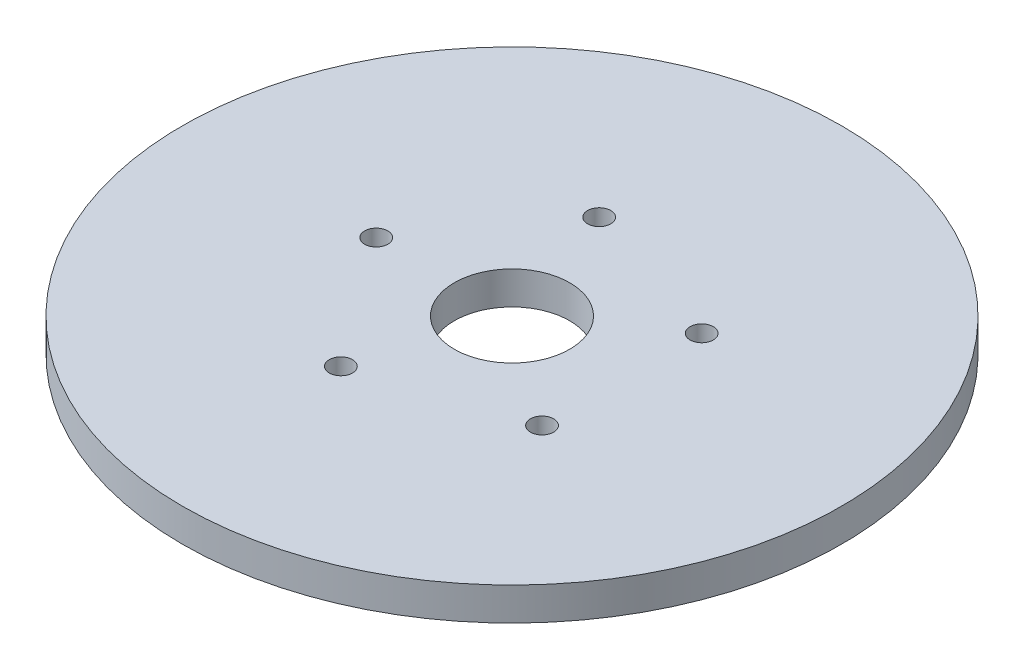
ISO-10303-21;
HEADER;
FILE_DESCRIPTION(('STEP AP214'),'2;1');
FILE_NAME('part.step','',(''),(''),'','','');
FILE_SCHEMA(('AUTOMOTIVE_DESIGN { 1 0 10303 214 1 1 1 1 }'));
ENDSEC;
DATA;
#1=APPLICATION_CONTEXT('core data for automotive mechanical design processes');
#2=APPLICATION_PROTOCOL_DEFINITION('international standard','automotive_design',2000,#1);
#3=PRODUCT_CONTEXT('',#1,'mechanical');
#4=PRODUCT('Part','Part','',(#3));
#5=PRODUCT_RELATED_PRODUCT_CATEGORY('part','',(#4));
#6=PRODUCT_DEFINITION_FORMATION('','',#4);
#7=PRODUCT_DEFINITION_CONTEXT('part definition',#1,'design');
#8=PRODUCT_DEFINITION('design','',#6,#7);
#9=PRODUCT_DEFINITION_SHAPE('','',#8);
#10=(LENGTH_UNIT() NAMED_UNIT(*) SI_UNIT(.MILLI.,.METRE.));
#11=(NAMED_UNIT(*) PLANE_ANGLE_UNIT() SI_UNIT($,.RADIAN.));
#12=(NAMED_UNIT(*) SI_UNIT($,.STERADIAN.) SOLID_ANGLE_UNIT());
#13=UNCERTAINTY_MEASURE_WITH_UNIT(LENGTH_MEASURE(1.E-05),#10,'distance_accuracy_value','');
#14=(GEOMETRIC_REPRESENTATION_CONTEXT(3) GLOBAL_UNCERTAINTY_ASSIGNED_CONTEXT((#13)) GLOBAL_UNIT_ASSIGNED_CONTEXT((#10,
#11,#12)) REPRESENTATION_CONTEXT('',''));
#15=CARTESIAN_POINT('',(0.,0.,0.));
#16=DIRECTION('',(0.,0.,1.));
#17=DIRECTION('',(1.,0.,0.));
#18=AXIS2_PLACEMENT_3D('',#15,#16,#17);
#19=CARTESIAN_POINT('',(0.,10.,0.));
#20=DIRECTION('',(0.,-1.,0.));
#21=DIRECTION('',(0.,0.,-1.));
#22=AXIS2_PLACEMENT_3D('',#19,#20,#21);
#23=CYLINDRICAL_SURFACE('',#22,100.);
#24=CARTESIAN_POINT('',(0.,10.,0.));
#25=DIRECTION('',(0.,1.,0.));
#26=DIRECTION('',(0.,0.,1.));
#27=AXIS2_PLACEMENT_3D('',#24,#25,#26);
#28=CIRCLE('',#27,100.);
#29=CARTESIAN_POINT('',(0.,10.,100.));
#30=VERTEX_POINT('',#29);
#31=EDGE_CURVE('E10',#30,#30,#28,.T.);
#32=ORIENTED_EDGE('',*,*,#31,.F.);
#33=EDGE_LOOP('',(#32));
#34=FACE_BOUND('',#33,.T.);
#35=CARTESIAN_POINT('',(0.,0.,0.));
#36=DIRECTION('',(0.,1.,0.));
#37=DIRECTION('',(0.,0.,1.));
#38=AXIS2_PLACEMENT_3D('',#35,#36,#37);
#39=CIRCLE('',#38,100.);
#40=CARTESIAN_POINT('',(0.,0.,100.));
#41=VERTEX_POINT('',#40);
#42=EDGE_CURVE('E37',#41,#41,#39,.T.);
#43=ORIENTED_EDGE('',*,*,#42,.T.);
#44=EDGE_LOOP('',(#43));
#45=FACE_BOUND('',#44,.T.);
#46=ADVANCED_FACE('F40',(#34,#45),#23,.T.);
#47=CARTESIAN_POINT('',(0.,10.,0.));
#48=DIRECTION('',(0.,1.,0.));
#49=DIRECTION('',(0.,0.,1.));
#50=AXIS2_PLACEMENT_3D('',#47,#48,#49);
#51=PLANE('',#50);
#52=CARTESIAN_POINT('',(-12.7339769297257,10.,39.1911511593866));
#53=DIRECTION('',(0.,1.,0.));
#54=DIRECTION('',(0.951056516295155,0.,0.309016994374945));
#55=AXIS2_PLACEMENT_3D('',#52,#53,#54);
#56=CIRCLE('',#55,3.52081027373652);
#57=CARTESIAN_POINT('',(-12.7339769297257,10.,42.7119614331232));
#58=VERTEX_POINT('',#57);
#59=EDGE_CURVE('E78',#58,#58,#56,.T.);
#60=ORIENTED_EDGE('',*,*,#59,.F.);
#61=EDGE_LOOP('',(#60));
#62=FACE_BOUND('',#61,.T.);
#63=CARTESIAN_POINT('',(33.3379844139793,10.,24.2214634747356));
#64=DIRECTION('',(0.,1.,0.));
#65=DIRECTION('',(0.587785252292469,0.,-0.809016994374951));
#66=AXIS2_PLACEMENT_3D('',#63,#64,#65);
#67=CIRCLE('',#66,3.52081027373652);
#68=CARTESIAN_POINT('',(33.3379844139793,10.,27.7422737484721));
#69=VERTEX_POINT('',#68);
#70=EDGE_CURVE('E71',#69,#69,#67,.T.);
#71=ORIENTED_EDGE('',*,*,#70,.F.);
#72=EDGE_LOOP('',(#71));
#73=FACE_BOUND('',#72,.T.);
#74=CARTESIAN_POINT('',(33.337984413979,10.,-24.2214634747361));
#75=DIRECTION('',(0.,1.,0.));
#76=DIRECTION('',(-0.58778525229248,0.,-0.809016994374942));
#77=AXIS2_PLACEMENT_3D('',#74,#75,#76);
#78=CIRCLE('',#77,3.52081027373652);
#79=CARTESIAN_POINT('',(33.337984413979,10.,-20.7006532009995));
#80=VERTEX_POINT('',#79);
#81=EDGE_CURVE('E70',#80,#80,#78,.T.);
#82=ORIENTED_EDGE('',*,*,#81,.F.);
#83=EDGE_LOOP('',(#82));
#84=FACE_BOUND('',#83,.T.);
#85=CARTESIAN_POINT('',(-12.7339769297262,10.,-39.1911511593865));
#86=DIRECTION('',(0.,1.,0.));
#87=DIRECTION('',(-0.95105651629515,0.,0.309016994374958));
#88=AXIS2_PLACEMENT_3D('',#85,#86,#87);
#89=CIRCLE('',#88,3.52081027373652);
#90=CARTESIAN_POINT('',(-12.7339769297262,10.,-35.6703408856499));
#91=VERTEX_POINT('',#90);
#92=EDGE_CURVE('E61',#91,#91,#89,.T.);
#93=ORIENTED_EDGE('',*,*,#92,.F.);
#94=EDGE_LOOP('',(#93));
#95=FACE_BOUND('',#94,.T.);
#96=CARTESIAN_POINT('',(-41.2080149685068,10.,0.));
#97=DIRECTION('',(0.,1.,0.));
#98=DIRECTION('',(0.,0.,1.));
#99=AXIS2_PLACEMENT_3D('',#96,#97,#98);
#100=CIRCLE('',#99,3.52081027373652);
#101=CARTESIAN_POINT('',(-41.2080149685068,10.,3.52081027373652));
#102=VERTEX_POINT('',#101);
#103=EDGE_CURVE('E54',#102,#102,#100,.T.);
#104=ORIENTED_EDGE('',*,*,#103,.F.);
#105=EDGE_LOOP('',(#104));
#106=FACE_BOUND('',#105,.T.);
#107=CARTESIAN_POINT('',(0.,10.,0.));
#108=DIRECTION('',(0.,1.,0.));
#109=DIRECTION('',(0.,0.,1.));
#110=AXIS2_PLACEMENT_3D('',#107,#108,#109);
#111=CIRCLE('',#110,17.5);
#112=CARTESIAN_POINT('',(0.,10.,17.5));
#113=VERTEX_POINT('',#112);
#114=EDGE_CURVE('E50',#113,#113,#111,.T.);
#115=ORIENTED_EDGE('',*,*,#114,.F.);
#116=EDGE_LOOP('',(#115));
#117=FACE_BOUND('',#116,.T.);
#118=ORIENTED_EDGE('',*,*,#31,.T.);
#119=EDGE_LOOP('',(#118));
#120=FACE_BOUND('',#119,.T.);
#121=ADVANCED_FACE('F94',(#62,#73,#84,#95,#106,#117,#120),#51,.T.);
#122=CARTESIAN_POINT('',(0.,0.,0.));
#123=DIRECTION('',(0.,1.,0.));
#124=DIRECTION('',(0.,0.,1.));
#125=AXIS2_PLACEMENT_3D('',#122,#123,#124);
#126=PLANE('',#125);
#127=CARTESIAN_POINT('',(0.,0.,0.));
#128=DIRECTION('',(0.,1.,0.));
#129=DIRECTION('',(0.,0.,1.));
#130=AXIS2_PLACEMENT_3D('',#127,#128,#129);
#131=CIRCLE('',#130,17.5);
#132=CARTESIAN_POINT('',(0.,0.,17.5));
#133=VERTEX_POINT('',#132);
#134=EDGE_CURVE('E47',#133,#133,#131,.T.);
#135=ORIENTED_EDGE('',*,*,#134,.T.);
#136=EDGE_LOOP('',(#135));
#137=FACE_BOUND('',#136,.T.);
#138=ORIENTED_EDGE('',*,*,#42,.F.);
#139=EDGE_LOOP('',(#138));
#140=FACE_BOUND('',#139,.T.);
#141=ADVANCED_FACE('F100',(#137,#140),#126,.F.);
#142=CARTESIAN_POINT('',(0.,10.,0.));
#143=DIRECTION('',(0.,-1.,0.));
#144=DIRECTION('',(0.,0.,-1.));
#145=AXIS2_PLACEMENT_3D('',#142,#143,#144);
#146=CYLINDRICAL_SURFACE('',#145,17.5);
#147=ORIENTED_EDGE('',*,*,#114,.T.);
#148=EDGE_LOOP('',(#147));
#149=FACE_BOUND('',#148,.T.);
#150=ORIENTED_EDGE('',*,*,#134,.F.);
#151=EDGE_LOOP('',(#150));
#152=FACE_BOUND('',#151,.T.);
#153=ADVANCED_FACE('F108',(#149,#152),#146,.F.);
#154=CARTESIAN_POINT('',(-41.2080149685068,2.43888670709305,0.));
#155=DIRECTION('',(0.,1.,0.));
#156=DIRECTION('',(0.,0.,1.));
#157=AXIS2_PLACEMENT_3D('',#154,#155,#156);
#158=CYLINDRICAL_SURFACE('',#157,3.52081027373652);
#159=CARTESIAN_POINT('',(-41.2080149685068,2.43888670709305,0.));
#160=DIRECTION('',(0.,1.,0.));
#161=DIRECTION('',(0.,0.,1.));
#162=AXIS2_PLACEMENT_3D('',#159,#160,#161);
#163=CIRCLE('',#162,3.52081027373652);
#164=CARTESIAN_POINT('',(-41.2080149685068,2.43888670709305,3.52081027373652));
#165=VERTEX_POINT('',#164);
#166=EDGE_CURVE('E55',#165,#165,#163,.T.);
#167=CARTESIAN_POINT('',(-41.2080149685068,2.43888670709305,3.52081027373652));
#168=CARTESIAN_POINT('',(-41.2080149685068,2.51764830389416,3.52081027373652));
#169=CARTESIAN_POINT('',(-41.2080149685068,2.59640990069528,3.52081027373652));
#170=CARTESIAN_POINT('',(-41.2080149685068,2.75393309429751,3.52081027373652));
#171=CARTESIAN_POINT('',(-41.2080149685068,2.83269469109862,3.52081027373652));
#172=CARTESIAN_POINT('',(-41.2080149685068,2.99021788470085,3.52081027373652));
#173=CARTESIAN_POINT('',(-41.2080149685068,3.06897948150196,3.52081027373652));
#174=CARTESIAN_POINT('',(-41.2080149685068,3.22650267510419,3.52081027373652));
#175=CARTESIAN_POINT('',(-41.2080149685068,3.30526427190531,3.52081027373652));
#176=CARTESIAN_POINT('',(-41.2080149685068,3.46278746550753,3.52081027373652));
#177=CARTESIAN_POINT('',(-41.2080149685068,3.54154906230865,3.52081027373652));
#178=CARTESIAN_POINT('',(-41.2080149685068,3.69907225591088,3.52081027373652));
#179=CARTESIAN_POINT('',(-41.2080149685068,3.77783385271199,3.52081027373652));
#180=CARTESIAN_POINT('',(-41.2080149685068,3.93535704631422,3.52081027373652));
#181=CARTESIAN_POINT('',(-41.2080149685068,4.01411864311533,3.52081027373652));
#182=CARTESIAN_POINT('',(-41.2080149685068,4.17164183671756,3.52081027373652));
#183=CARTESIAN_POINT('',(-41.2080149685068,4.25040343351867,3.52081027373652));
#184=CARTESIAN_POINT('',(-41.2080149685068,4.4079266271209,3.52081027373652));
#185=CARTESIAN_POINT('',(-41.2080149685068,4.48668822392202,3.52081027373652));
#186=CARTESIAN_POINT('',(-41.2080149685068,4.64421141752424,3.52081027373652));
#187=CARTESIAN_POINT('',(-41.2080149685068,4.72297301432536,3.52081027373652));
#188=CARTESIAN_POINT('',(-41.2080149685068,4.88049620792759,3.52081027373652));
#189=CARTESIAN_POINT('',(-41.2080149685068,4.9592578047287,3.52081027373652));
#190=CARTESIAN_POINT('',(-41.2080149685068,5.11678099833093,3.52081027373652));
#191=CARTESIAN_POINT('',(-41.2080149685068,5.19554259513204,3.52081027373652));
#192=CARTESIAN_POINT('',(-41.2080149685068,5.35306578873427,3.52081027373652));
#193=CARTESIAN_POINT('',(-41.2080149685068,5.43182738553539,3.52081027373652));
#194=CARTESIAN_POINT('',(-41.2080149685068,5.58935057913761,3.52081027373652));
#195=CARTESIAN_POINT('',(-41.2080149685068,5.66811217593873,3.52081027373652));
#196=CARTESIAN_POINT('',(-41.2080149685068,5.82563536954095,3.52081027373652));
#197=CARTESIAN_POINT('',(-41.2080149685068,5.90439696634207,3.52081027373652));
#198=CARTESIAN_POINT('',(-41.2080149685068,6.0619201599443,3.52081027373652));
#199=CARTESIAN_POINT('',(-41.2080149685068,6.14068175674541,3.52081027373652));
#200=CARTESIAN_POINT('',(-41.2080149685068,6.29820495034764,3.52081027373652));
#201=CARTESIAN_POINT('',(-41.2080149685068,6.37696654714875,3.52081027373652));
#202=CARTESIAN_POINT('',(-41.2080149685068,6.53448974075098,3.52081027373652));
#203=CARTESIAN_POINT('',(-41.2080149685068,6.6132513375521,3.52081027373652));
#204=CARTESIAN_POINT('',(-41.2080149685068,6.77077453115432,3.52081027373652));
#205=CARTESIAN_POINT('',(-41.2080149685068,6.84953612795544,3.52081027373652));
#206=CARTESIAN_POINT('',(-41.2080149685068,7.00705932155767,3.52081027373652));
#207=CARTESIAN_POINT('',(-41.2080149685068,7.08582091835878,3.52081027373652));
#208=CARTESIAN_POINT('',(-41.2080149685068,7.24334411196101,3.52081027373652));
#209=CARTESIAN_POINT('',(-41.2080149685068,7.32210570876212,3.52081027373652));
#210=CARTESIAN_POINT('',(-41.2080149685068,7.47962890236435,3.52081027373652));
#211=CARTESIAN_POINT('',(-41.2080149685068,7.55839049916546,3.52081027373652));
#212=CARTESIAN_POINT('',(-41.2080149685068,7.71591369276769,3.52081027373652));
#213=CARTESIAN_POINT('',(-41.2080149685068,7.79467528956881,3.52081027373652));
#214=CARTESIAN_POINT('',(-41.2080149685068,7.95219848317103,3.52081027373652));
#215=CARTESIAN_POINT('',(-41.2080149685068,8.03096007997215,3.52081027373652));
#216=CARTESIAN_POINT('',(-41.2080149685068,8.18848327357438,3.52081027373652));
#217=CARTESIAN_POINT('',(-41.2080149685068,8.26724487037549,3.52081027373652));
#218=CARTESIAN_POINT('',(-41.2080149685068,8.42476806397772,3.52081027373652));
#219=CARTESIAN_POINT('',(-41.2080149685068,8.50352966077883,3.52081027373652));
#220=CARTESIAN_POINT('',(-41.2080149685068,8.66105285438106,3.52081027373652));
#221=CARTESIAN_POINT('',(-41.2080149685068,8.73981445118218,3.52081027373652));
#222=CARTESIAN_POINT('',(-41.2080149685068,8.8973376447844,3.52081027373652));
#223=CARTESIAN_POINT('',(-41.2080149685068,8.97609924158552,3.52081027373652));
#224=CARTESIAN_POINT('',(-41.2080149685068,9.13362243518775,3.52081027373652));
#225=CARTESIAN_POINT('',(-41.2080149685068,9.21238403198886,3.52081027373652));
#226=CARTESIAN_POINT('',(-41.2080149685068,9.36990722559109,3.52081027373652));
#227=CARTESIAN_POINT('',(-41.2080149685068,9.4486688223922,3.52081027373652));
#228=CARTESIAN_POINT('',(-41.2080149685068,9.60619201599443,3.52081027373652));
#229=CARTESIAN_POINT('',(-41.2080149685068,9.68495361279554,3.52081027373652));
#230=CARTESIAN_POINT('',(-41.2080149685068,9.84247680639777,3.52081027373652));
#231=CARTESIAN_POINT('',(-41.2080149685068,9.92123840319889,3.52081027373652));
#232=CARTESIAN_POINT('',(-41.2080149685068,10.,3.52081027373652));
#233=B_SPLINE_CURVE_WITH_KNOTS('',3,(#167,#168,#169,#170,#171,#172,#173,#174,#175,#176,#177,
#178,#179,#180,#181,#182,#183,#184,#185,#186,#187,#188,#189,#190,#191,#192,#193,#194,#195,#196,
#197,#198,#199,#200,#201,#202,#203,#204,#205,#206,#207,#208,#209,#210,#211,#212,#213,#214,#215,
#216,#217,#218,#219,#220,#221,#222,#223,#224,#225,#226,#227,#228,#229,#230,#231,#232),
.UNSPECIFIED.,.F.,.F.,(4,2,2,2,2,2,2,2,2,2,2,2,2,2,2,2,2,2,2,2,2,2,2,2,2,2,2,2,2,2,2,2,4),(0.,
0.236284790403342,0.472569580806684,0.708854371210027,0.945139161613369,1.18142395201671,
1.41770874242005,1.6539935328234,1.89027832322674,2.12656311363008,2.36284790403342,
2.59913269443676,2.83541748484011,3.07170227524345,3.30798706564679,3.54427185605013,
3.78055664645347,4.01684143685682,4.25312622726016,4.4894110176635,4.72569580806684,
4.96198059847019,5.19826538887353,5.43455017927687,5.67083496968021,5.90711976008355,
6.1434045504869,6.37968934089024,6.61597413129358,6.85225892169692,7.08854371210026,
7.32482850250361,7.56111329290695),.UNSPECIFIED.);
#234=EDGE_CURVE('BSEAM115',#165,#102,#233,.T.);
#235=ORIENTED_EDGE('',*,*,#166,.F.);
#236=ORIENTED_EDGE('',*,*,#103,.T.);
#237=ORIENTED_EDGE('',*,*,#234,.T.);
#238=ORIENTED_EDGE('',*,*,#234,.F.);
#239=EDGE_LOOP('',(#235,#237,#236,#238));
#240=FACE_BOUND('',#239,.T.);
#241=ADVANCED_FACE('F115',(#240),#158,.F.);
#242=CARTESIAN_POINT('',(-41.2080149685068,2.43888670709305,0.));
#243=DIRECTION('',(0.,1.,0.));
#244=DIRECTION('',(0.,0.,1.));
#245=AXIS2_PLACEMENT_3D('',#242,#243,#244);
#246=PLANE('',#245);
#247=ORIENTED_EDGE('',*,*,#166,.T.);
#248=EDGE_LOOP('',(#247));
#249=FACE_BOUND('',#248,.T.);
#250=ADVANCED_FACE('F142',(#249),#246,.T.);
#251=CARTESIAN_POINT('',(-12.7339769297262,2.43888670709305,-39.1911511593865));
#252=DIRECTION('',(0.,1.,0.));
#253=DIRECTION('',(0.,0.,1.));
#254=AXIS2_PLACEMENT_3D('',#251,#252,#253);
#255=CYLINDRICAL_SURFACE('',#254,3.52081027373652);
#256=CARTESIAN_POINT('',(-12.7339769297262,2.43888670709305,-39.1911511593865));
#257=DIRECTION('',(0.,1.,0.));
#258=DIRECTION('',(-0.95105651629515,0.,0.309016994374958));
#259=AXIS2_PLACEMENT_3D('',#256,#257,#258);
#260=CIRCLE('',#259,3.52081027373652);
#261=CARTESIAN_POINT('',(-12.7339769297262,2.43888670709305,-35.6703408856499));
#262=VERTEX_POINT('',#261);
#263=EDGE_CURVE('E63',#262,#262,#260,.T.);
#264=CARTESIAN_POINT('',(-12.7339769297262,2.43888670709305,-35.6703408856499));
#265=CARTESIAN_POINT('',(-12.7339769297262,2.51764830389416,-35.6703408856499));
#266=CARTESIAN_POINT('',(-12.7339769297262,2.59640990069528,-35.6703408856499));
#267=CARTESIAN_POINT('',(-12.7339769297262,2.75393309429751,-35.6703408856499));
#268=CARTESIAN_POINT('',(-12.7339769297262,2.83269469109862,-35.6703408856499));
#269=CARTESIAN_POINT('',(-12.7339769297262,2.99021788470085,-35.6703408856499));
#270=CARTESIAN_POINT('',(-12.7339769297262,3.06897948150196,-35.6703408856499));
#271=CARTESIAN_POINT('',(-12.7339769297262,3.22650267510419,-35.6703408856499));
#272=CARTESIAN_POINT('',(-12.7339769297262,3.30526427190531,-35.6703408856499));
#273=CARTESIAN_POINT('',(-12.7339769297262,3.46278746550753,-35.6703408856499));
#274=CARTESIAN_POINT('',(-12.7339769297262,3.54154906230865,-35.6703408856499));
#275=CARTESIAN_POINT('',(-12.7339769297262,3.69907225591088,-35.6703408856499));
#276=CARTESIAN_POINT('',(-12.7339769297262,3.77783385271199,-35.6703408856499));
#277=CARTESIAN_POINT('',(-12.7339769297262,3.93535704631422,-35.6703408856499));
#278=CARTESIAN_POINT('',(-12.7339769297262,4.01411864311533,-35.6703408856499));
#279=CARTESIAN_POINT('',(-12.7339769297262,4.17164183671756,-35.6703408856499));
#280=CARTESIAN_POINT('',(-12.7339769297262,4.25040343351867,-35.6703408856499));
#281=CARTESIAN_POINT('',(-12.7339769297262,4.4079266271209,-35.6703408856499));
#282=CARTESIAN_POINT('',(-12.7339769297262,4.48668822392202,-35.6703408856499));
#283=CARTESIAN_POINT('',(-12.7339769297262,4.64421141752424,-35.6703408856499));
#284=CARTESIAN_POINT('',(-12.7339769297262,4.72297301432536,-35.6703408856499));
#285=CARTESIAN_POINT('',(-12.7339769297262,4.88049620792759,-35.6703408856499));
#286=CARTESIAN_POINT('',(-12.7339769297262,4.9592578047287,-35.6703408856499));
#287=CARTESIAN_POINT('',(-12.7339769297262,5.11678099833093,-35.6703408856499));
#288=CARTESIAN_POINT('',(-12.7339769297262,5.19554259513204,-35.6703408856499));
#289=CARTESIAN_POINT('',(-12.7339769297262,5.35306578873427,-35.6703408856499));
#290=CARTESIAN_POINT('',(-12.7339769297262,5.43182738553539,-35.6703408856499));
#291=CARTESIAN_POINT('',(-12.7339769297262,5.58935057913761,-35.6703408856499));
#292=CARTESIAN_POINT('',(-12.7339769297262,5.66811217593873,-35.6703408856499));
#293=CARTESIAN_POINT('',(-12.7339769297262,5.82563536954095,-35.6703408856499));
#294=CARTESIAN_POINT('',(-12.7339769297262,5.90439696634207,-35.6703408856499));
#295=CARTESIAN_POINT('',(-12.7339769297262,6.0619201599443,-35.6703408856499));
#296=CARTESIAN_POINT('',(-12.7339769297262,6.14068175674541,-35.6703408856499));
#297=CARTESIAN_POINT('',(-12.7339769297262,6.29820495034764,-35.6703408856499));
#298=CARTESIAN_POINT('',(-12.7339769297262,6.37696654714875,-35.6703408856499));
#299=CARTESIAN_POINT('',(-12.7339769297262,6.53448974075098,-35.6703408856499));
#300=CARTESIAN_POINT('',(-12.7339769297262,6.6132513375521,-35.6703408856499));
#301=CARTESIAN_POINT('',(-12.7339769297262,6.77077453115432,-35.6703408856499));
#302=CARTESIAN_POINT('',(-12.7339769297262,6.84953612795544,-35.6703408856499));
#303=CARTESIAN_POINT('',(-12.7339769297262,7.00705932155767,-35.6703408856499));
#304=CARTESIAN_POINT('',(-12.7339769297262,7.08582091835878,-35.6703408856499));
#305=CARTESIAN_POINT('',(-12.7339769297262,7.24334411196101,-35.6703408856499));
#306=CARTESIAN_POINT('',(-12.7339769297262,7.32210570876212,-35.6703408856499));
#307=CARTESIAN_POINT('',(-12.7339769297262,7.47962890236435,-35.6703408856499));
#308=CARTESIAN_POINT('',(-12.7339769297262,7.55839049916546,-35.6703408856499));
#309=CARTESIAN_POINT('',(-12.7339769297262,7.71591369276769,-35.6703408856499));
#310=CARTESIAN_POINT('',(-12.7339769297262,7.79467528956881,-35.6703408856499));
#311=CARTESIAN_POINT('',(-12.7339769297262,7.95219848317103,-35.6703408856499));
#312=CARTESIAN_POINT('',(-12.7339769297262,8.03096007997215,-35.6703408856499));
#313=CARTESIAN_POINT('',(-12.7339769297262,8.18848327357438,-35.6703408856499));
#314=CARTESIAN_POINT('',(-12.7339769297262,8.26724487037549,-35.6703408856499));
#315=CARTESIAN_POINT('',(-12.7339769297262,8.42476806397772,-35.6703408856499));
#316=CARTESIAN_POINT('',(-12.7339769297262,8.50352966077883,-35.6703408856499));
#317=CARTESIAN_POINT('',(-12.7339769297262,8.66105285438106,-35.6703408856499));
#318=CARTESIAN_POINT('',(-12.7339769297262,8.73981445118218,-35.6703408856499));
#319=CARTESIAN_POINT('',(-12.7339769297262,8.8973376447844,-35.6703408856499));
#320=CARTESIAN_POINT('',(-12.7339769297262,8.97609924158552,-35.6703408856499));
#321=CARTESIAN_POINT('',(-12.7339769297262,9.13362243518775,-35.6703408856499));
#322=CARTESIAN_POINT('',(-12.7339769297262,9.21238403198886,-35.6703408856499));
#323=CARTESIAN_POINT('',(-12.7339769297262,9.36990722559109,-35.6703408856499));
#324=CARTESIAN_POINT('',(-12.7339769297262,9.4486688223922,-35.6703408856499));
#325=CARTESIAN_POINT('',(-12.7339769297262,9.60619201599443,-35.6703408856499));
#326=CARTESIAN_POINT('',(-12.7339769297262,9.68495361279554,-35.6703408856499));
#327=CARTESIAN_POINT('',(-12.7339769297262,9.84247680639777,-35.6703408856499));
#328=CARTESIAN_POINT('',(-12.7339769297262,9.92123840319889,-35.6703408856499));
#329=CARTESIAN_POINT('',(-12.7339769297262,10.,-35.6703408856499));
#330=B_SPLINE_CURVE_WITH_KNOTS('',3,(#264,#265,#266,#267,#268,#269,#270,#271,#272,#273,#274,
#275,#276,#277,#278,#279,#280,#281,#282,#283,#284,#285,#286,#287,#288,#289,#290,#291,#292,#293,
#294,#295,#296,#297,#298,#299,#300,#301,#302,#303,#304,#305,#306,#307,#308,#309,#310,#311,#312,
#313,#314,#315,#316,#317,#318,#319,#320,#321,#322,#323,#324,#325,#326,#327,#328,#329),
.UNSPECIFIED.,.F.,.F.,(4,2,2,2,2,2,2,2,2,2,2,2,2,2,2,2,2,2,2,2,2,2,2,2,2,2,2,2,2,2,2,2,4),(0.,
0.236284790403342,0.472569580806684,0.708854371210027,0.945139161613369,1.18142395201671,
1.41770874242005,1.6539935328234,1.89027832322674,2.12656311363008,2.36284790403342,
2.59913269443676,2.83541748484011,3.07170227524345,3.30798706564679,3.54427185605013,
3.78055664645347,4.01684143685682,4.25312622726016,4.4894110176635,4.72569580806684,
4.96198059847019,5.19826538887353,5.43455017927687,5.67083496968021,5.90711976008355,
6.1434045504869,6.37968934089024,6.61597413129358,6.85225892169692,7.08854371210026,
7.32482850250361,7.56111329290695),.UNSPECIFIED.);
#331=EDGE_CURVE('BSEAM147',#262,#91,#330,.T.);
#332=ORIENTED_EDGE('',*,*,#263,.F.);
#333=ORIENTED_EDGE('',*,*,#92,.T.);
#334=ORIENTED_EDGE('',*,*,#331,.T.);
#335=ORIENTED_EDGE('',*,*,#331,.F.);
#336=EDGE_LOOP('',(#332,#334,#333,#335));
#337=FACE_BOUND('',#336,.T.);
#338=ADVANCED_FACE('F147',(#337),#255,.F.);
#339=CARTESIAN_POINT('',(-12.7339769297262,2.43888670709305,-39.1911511593865));
#340=DIRECTION('',(0.,1.,0.));
#341=DIRECTION('',(-0.95105651629515,0.,0.309016994374958));
#342=AXIS2_PLACEMENT_3D('',#339,#340,#341);
#343=PLANE('',#342);
#344=ORIENTED_EDGE('',*,*,#263,.T.);
#345=EDGE_LOOP('',(#344));
#346=FACE_BOUND('',#345,.T.);
#347=ADVANCED_FACE('F163',(#346),#343,.T.);
#348=CARTESIAN_POINT('',(33.337984413979,2.43888670709305,-24.2214634747361));
#349=DIRECTION('',(0.,1.,0.));
#350=DIRECTION('',(0.,0.,1.));
#351=AXIS2_PLACEMENT_3D('',#348,#349,#350);
#352=CYLINDRICAL_SURFACE('',#351,3.52081027373652);
#353=CARTESIAN_POINT('',(33.337984413979,2.43888670709305,-24.2214634747361));
#354=DIRECTION('',(0.,1.,0.));
#355=DIRECTION('',(-0.58778525229248,0.,-0.809016994374942));
#356=AXIS2_PLACEMENT_3D('',#353,#354,#355);
#357=CIRCLE('',#356,3.52081027373652);
#358=CARTESIAN_POINT('',(33.337984413979,2.43888670709305,-20.7006532009995));
#359=VERTEX_POINT('',#358);
#360=EDGE_CURVE('E69',#359,#359,#357,.T.);
#361=CARTESIAN_POINT('',(33.337984413979,2.43888670709305,-20.7006532009995));
#362=CARTESIAN_POINT('',(33.337984413979,2.51764830389416,-20.7006532009995));
#363=CARTESIAN_POINT('',(33.337984413979,2.59640990069528,-20.7006532009995));
#364=CARTESIAN_POINT('',(33.337984413979,2.75393309429751,-20.7006532009995));
#365=CARTESIAN_POINT('',(33.337984413979,2.83269469109862,-20.7006532009995));
#366=CARTESIAN_POINT('',(33.337984413979,2.99021788470085,-20.7006532009995));
#367=CARTESIAN_POINT('',(33.337984413979,3.06897948150196,-20.7006532009995));
#368=CARTESIAN_POINT('',(33.337984413979,3.22650267510419,-20.7006532009995));
#369=CARTESIAN_POINT('',(33.337984413979,3.30526427190531,-20.7006532009995));
#370=CARTESIAN_POINT('',(33.337984413979,3.46278746550753,-20.7006532009995));
#371=CARTESIAN_POINT('',(33.337984413979,3.54154906230865,-20.7006532009995));
#372=CARTESIAN_POINT('',(33.337984413979,3.69907225591088,-20.7006532009995));
#373=CARTESIAN_POINT('',(33.337984413979,3.77783385271199,-20.7006532009995));
#374=CARTESIAN_POINT('',(33.337984413979,3.93535704631422,-20.7006532009995));
#375=CARTESIAN_POINT('',(33.337984413979,4.01411864311533,-20.7006532009995));
#376=CARTESIAN_POINT('',(33.337984413979,4.17164183671756,-20.7006532009995));
#377=CARTESIAN_POINT('',(33.337984413979,4.25040343351867,-20.7006532009995));
#378=CARTESIAN_POINT('',(33.337984413979,4.4079266271209,-20.7006532009995));
#379=CARTESIAN_POINT('',(33.337984413979,4.48668822392202,-20.7006532009995));
#380=CARTESIAN_POINT('',(33.337984413979,4.64421141752424,-20.7006532009995));
#381=CARTESIAN_POINT('',(33.337984413979,4.72297301432536,-20.7006532009995));
#382=CARTESIAN_POINT('',(33.337984413979,4.88049620792759,-20.7006532009995));
#383=CARTESIAN_POINT('',(33.337984413979,4.9592578047287,-20.7006532009995));
#384=CARTESIAN_POINT('',(33.337984413979,5.11678099833093,-20.7006532009995));
#385=CARTESIAN_POINT('',(33.337984413979,5.19554259513204,-20.7006532009995));
#386=CARTESIAN_POINT('',(33.337984413979,5.35306578873427,-20.7006532009995));
#387=CARTESIAN_POINT('',(33.337984413979,5.43182738553539,-20.7006532009995));
#388=CARTESIAN_POINT('',(33.337984413979,5.58935057913761,-20.7006532009995));
#389=CARTESIAN_POINT('',(33.337984413979,5.66811217593873,-20.7006532009995));
#390=CARTESIAN_POINT('',(33.337984413979,5.82563536954095,-20.7006532009995));
#391=CARTESIAN_POINT('',(33.337984413979,5.90439696634207,-20.7006532009995));
#392=CARTESIAN_POINT('',(33.337984413979,6.0619201599443,-20.7006532009995));
#393=CARTESIAN_POINT('',(33.337984413979,6.14068175674541,-20.7006532009995));
#394=CARTESIAN_POINT('',(33.337984413979,6.29820495034764,-20.7006532009995));
#395=CARTESIAN_POINT('',(33.337984413979,6.37696654714875,-20.7006532009995));
#396=CARTESIAN_POINT('',(33.337984413979,6.53448974075098,-20.7006532009995));
#397=CARTESIAN_POINT('',(33.337984413979,6.6132513375521,-20.7006532009995));
#398=CARTESIAN_POINT('',(33.337984413979,6.77077453115432,-20.7006532009995));
#399=CARTESIAN_POINT('',(33.337984413979,6.84953612795544,-20.7006532009995));
#400=CARTESIAN_POINT('',(33.337984413979,7.00705932155767,-20.7006532009995));
#401=CARTESIAN_POINT('',(33.337984413979,7.08582091835878,-20.7006532009995));
#402=CARTESIAN_POINT('',(33.337984413979,7.24334411196101,-20.7006532009995));
#403=CARTESIAN_POINT('',(33.337984413979,7.32210570876212,-20.7006532009995));
#404=CARTESIAN_POINT('',(33.337984413979,7.47962890236435,-20.7006532009995));
#405=CARTESIAN_POINT('',(33.337984413979,7.55839049916546,-20.7006532009995));
#406=CARTESIAN_POINT('',(33.337984413979,7.71591369276769,-20.7006532009995));
#407=CARTESIAN_POINT('',(33.337984413979,7.79467528956881,-20.7006532009995));
#408=CARTESIAN_POINT('',(33.337984413979,7.95219848317103,-20.7006532009995));
#409=CARTESIAN_POINT('',(33.337984413979,8.03096007997215,-20.7006532009995));
#410=CARTESIAN_POINT('',(33.337984413979,8.18848327357438,-20.7006532009995));
#411=CARTESIAN_POINT('',(33.337984413979,8.26724487037549,-20.7006532009995));
#412=CARTESIAN_POINT('',(33.337984413979,8.42476806397772,-20.7006532009995));
#413=CARTESIAN_POINT('',(33.337984413979,8.50352966077883,-20.7006532009995));
#414=CARTESIAN_POINT('',(33.337984413979,8.66105285438106,-20.7006532009995));
#415=CARTESIAN_POINT('',(33.337984413979,8.73981445118218,-20.7006532009995));
#416=CARTESIAN_POINT('',(33.337984413979,8.8973376447844,-20.7006532009995));
#417=CARTESIAN_POINT('',(33.337984413979,8.97609924158552,-20.7006532009995));
#418=CARTESIAN_POINT('',(33.337984413979,9.13362243518775,-20.7006532009995));
#419=CARTESIAN_POINT('',(33.337984413979,9.21238403198886,-20.7006532009995));
#420=CARTESIAN_POINT('',(33.337984413979,9.36990722559109,-20.7006532009995));
#421=CARTESIAN_POINT('',(33.337984413979,9.4486688223922,-20.7006532009995));
#422=CARTESIAN_POINT('',(33.337984413979,9.60619201599443,-20.7006532009995));
#423=CARTESIAN_POINT('',(33.337984413979,9.68495361279554,-20.7006532009995));
#424=CARTESIAN_POINT('',(33.337984413979,9.84247680639777,-20.7006532009995));
#425=CARTESIAN_POINT('',(33.337984413979,9.92123840319889,-20.7006532009995));
#426=CARTESIAN_POINT('',(33.337984413979,10.,-20.7006532009995));
#427=B_SPLINE_CURVE_WITH_KNOTS('',3,(#361,#362,#363,#364,#365,#366,#367,#368,#369,#370,#371,
#372,#373,#374,#375,#376,#377,#378,#379,#380,#381,#382,#383,#384,#385,#386,#387,#388,#389,#390,
#391,#392,#393,#394,#395,#396,#397,#398,#399,#400,#401,#402,#403,#404,#405,#406,#407,#408,#409,
#410,#411,#412,#413,#414,#415,#416,#417,#418,#419,#420,#421,#422,#423,#424,#425,#426),
.UNSPECIFIED.,.F.,.F.,(4,2,2,2,2,2,2,2,2,2,2,2,2,2,2,2,2,2,2,2,2,2,2,2,2,2,2,2,2,2,2,2,4),(0.,
0.236284790403342,0.472569580806684,0.708854371210027,0.945139161613369,1.18142395201671,
1.41770874242005,1.6539935328234,1.89027832322674,2.12656311363008,2.36284790403342,
2.59913269443676,2.83541748484011,3.07170227524345,3.30798706564679,3.54427185605013,
3.78055664645347,4.01684143685682,4.25312622726016,4.4894110176635,4.72569580806684,
4.96198059847019,5.19826538887353,5.43455017927687,5.67083496968021,5.90711976008355,
6.1434045504869,6.37968934089024,6.61597413129358,6.85225892169692,7.08854371210026,
7.32482850250361,7.56111329290695),.UNSPECIFIED.);
#428=EDGE_CURVE('BSEAM172',#359,#80,#427,.T.);
#429=ORIENTED_EDGE('',*,*,#360,.F.);
#430=ORIENTED_EDGE('',*,*,#81,.T.);
#431=ORIENTED_EDGE('',*,*,#428,.T.);
#432=ORIENTED_EDGE('',*,*,#428,.F.);
#433=EDGE_LOOP('',(#429,#431,#430,#432));
#434=FACE_BOUND('',#433,.T.);
#435=ADVANCED_FACE('F172',(#434),#352,.F.);
#436=CARTESIAN_POINT('',(33.337984413979,2.43888670709305,-24.2214634747361));
#437=DIRECTION('',(0.,1.,0.));
#438=DIRECTION('',(-0.58778525229248,0.,-0.809016994374942));
#439=AXIS2_PLACEMENT_3D('',#436,#437,#438);
#440=PLANE('',#439);
#441=ORIENTED_EDGE('',*,*,#360,.T.);
#442=EDGE_LOOP('',(#441));
#443=FACE_BOUND('',#442,.T.);
#444=ADVANCED_FACE('F185',(#443),#440,.T.);
#445=CARTESIAN_POINT('',(33.3379844139793,2.43888670709305,24.2214634747356));
#446=DIRECTION('',(0.,1.,0.));
#447=DIRECTION('',(0.,0.,1.));
#448=AXIS2_PLACEMENT_3D('',#445,#446,#447);
#449=CYLINDRICAL_SURFACE('',#448,3.52081027373652);
#450=CARTESIAN_POINT('',(33.3379844139793,2.43888670709305,24.2214634747356));
#451=DIRECTION('',(0.,1.,0.));
#452=DIRECTION('',(0.587785252292469,0.,-0.809016994374951));
#453=AXIS2_PLACEMENT_3D('',#450,#451,#452);
#454=CIRCLE('',#453,3.52081027373652);
#455=CARTESIAN_POINT('',(33.3379844139793,2.43888670709305,27.7422737484721));
#456=VERTEX_POINT('',#455);
#457=EDGE_CURVE('E76',#456,#456,#454,.T.);
#458=CARTESIAN_POINT('',(33.3379844139793,2.43888670709305,27.7422737484721));
#459=CARTESIAN_POINT('',(33.3379844139793,2.51764830389416,27.7422737484721));
#460=CARTESIAN_POINT('',(33.3379844139793,2.59640990069528,27.7422737484721));
#461=CARTESIAN_POINT('',(33.3379844139793,2.75393309429751,27.7422737484721));
#462=CARTESIAN_POINT('',(33.3379844139793,2.83269469109862,27.7422737484721));
#463=CARTESIAN_POINT('',(33.3379844139793,2.99021788470085,27.7422737484721));
#464=CARTESIAN_POINT('',(33.3379844139793,3.06897948150196,27.7422737484721));
#465=CARTESIAN_POINT('',(33.3379844139793,3.22650267510419,27.7422737484721));
#466=CARTESIAN_POINT('',(33.3379844139793,3.30526427190531,27.7422737484721));
#467=CARTESIAN_POINT('',(33.3379844139793,3.46278746550753,27.7422737484721));
#468=CARTESIAN_POINT('',(33.3379844139793,3.54154906230865,27.7422737484721));
#469=CARTESIAN_POINT('',(33.3379844139793,3.69907225591088,27.7422737484721));
#470=CARTESIAN_POINT('',(33.3379844139793,3.77783385271199,27.7422737484721));
#471=CARTESIAN_POINT('',(33.3379844139793,3.93535704631422,27.7422737484721));
#472=CARTESIAN_POINT('',(33.3379844139793,4.01411864311533,27.7422737484721));
#473=CARTESIAN_POINT('',(33.3379844139793,4.17164183671756,27.7422737484721));
#474=CARTESIAN_POINT('',(33.3379844139793,4.25040343351867,27.7422737484721));
#475=CARTESIAN_POINT('',(33.3379844139793,4.4079266271209,27.7422737484721));
#476=CARTESIAN_POINT('',(33.3379844139793,4.48668822392202,27.7422737484721));
#477=CARTESIAN_POINT('',(33.3379844139793,4.64421141752424,27.7422737484721));
#478=CARTESIAN_POINT('',(33.3379844139793,4.72297301432536,27.7422737484721));
#479=CARTESIAN_POINT('',(33.3379844139793,4.88049620792759,27.7422737484721));
#480=CARTESIAN_POINT('',(33.3379844139793,4.9592578047287,27.7422737484721));
#481=CARTESIAN_POINT('',(33.3379844139793,5.11678099833093,27.7422737484721));
#482=CARTESIAN_POINT('',(33.3379844139793,5.19554259513204,27.7422737484721));
#483=CARTESIAN_POINT('',(33.3379844139793,5.35306578873427,27.7422737484721));
#484=CARTESIAN_POINT('',(33.3379844139793,5.43182738553539,27.7422737484721));
#485=CARTESIAN_POINT('',(33.3379844139793,5.58935057913761,27.7422737484721));
#486=CARTESIAN_POINT('',(33.3379844139793,5.66811217593873,27.7422737484721));
#487=CARTESIAN_POINT('',(33.3379844139793,5.82563536954095,27.7422737484721));
#488=CARTESIAN_POINT('',(33.3379844139793,5.90439696634207,27.7422737484721));
#489=CARTESIAN_POINT('',(33.3379844139793,6.0619201599443,27.7422737484721));
#490=CARTESIAN_POINT('',(33.3379844139793,6.14068175674541,27.7422737484721));
#491=CARTESIAN_POINT('',(33.3379844139793,6.29820495034764,27.7422737484721));
#492=CARTESIAN_POINT('',(33.3379844139793,6.37696654714875,27.7422737484721));
#493=CARTESIAN_POINT('',(33.3379844139793,6.53448974075098,27.7422737484721));
#494=CARTESIAN_POINT('',(33.3379844139793,6.6132513375521,27.7422737484721));
#495=CARTESIAN_POINT('',(33.3379844139793,6.77077453115432,27.7422737484721));
#496=CARTESIAN_POINT('',(33.3379844139793,6.84953612795544,27.7422737484721));
#497=CARTESIAN_POINT('',(33.3379844139793,7.00705932155767,27.7422737484721));
#498=CARTESIAN_POINT('',(33.3379844139793,7.08582091835878,27.7422737484721));
#499=CARTESIAN_POINT('',(33.3379844139793,7.24334411196101,27.7422737484721));
#500=CARTESIAN_POINT('',(33.3379844139793,7.32210570876212,27.7422737484721));
#501=CARTESIAN_POINT('',(33.3379844139793,7.47962890236435,27.7422737484721));
#502=CARTESIAN_POINT('',(33.3379844139793,7.55839049916546,27.7422737484721));
#503=CARTESIAN_POINT('',(33.3379844139793,7.71591369276769,27.7422737484721));
#504=CARTESIAN_POINT('',(33.3379844139793,7.79467528956881,27.7422737484721));
#505=CARTESIAN_POINT('',(33.3379844139793,7.95219848317103,27.7422737484721));
#506=CARTESIAN_POINT('',(33.3379844139793,8.03096007997215,27.7422737484721));
#507=CARTESIAN_POINT('',(33.3379844139793,8.18848327357438,27.7422737484721));
#508=CARTESIAN_POINT('',(33.3379844139793,8.26724487037549,27.7422737484721));
#509=CARTESIAN_POINT('',(33.3379844139793,8.42476806397772,27.7422737484721));
#510=CARTESIAN_POINT('',(33.3379844139793,8.50352966077883,27.7422737484721));
#511=CARTESIAN_POINT('',(33.3379844139793,8.66105285438106,27.7422737484721));
#512=CARTESIAN_POINT('',(33.3379844139793,8.73981445118218,27.7422737484721));
#513=CARTESIAN_POINT('',(33.3379844139793,8.8973376447844,27.7422737484721));
#514=CARTESIAN_POINT('',(33.3379844139793,8.97609924158552,27.7422737484721));
#515=CARTESIAN_POINT('',(33.3379844139793,9.13362243518775,27.7422737484721));
#516=CARTESIAN_POINT('',(33.3379844139793,9.21238403198886,27.7422737484721));
#517=CARTESIAN_POINT('',(33.3379844139793,9.36990722559109,27.7422737484721));
#518=CARTESIAN_POINT('',(33.3379844139793,9.4486688223922,27.7422737484721));
#519=CARTESIAN_POINT('',(33.3379844139793,9.60619201599443,27.7422737484721));
#520=CARTESIAN_POINT('',(33.3379844139793,9.68495361279554,27.7422737484721));
#521=CARTESIAN_POINT('',(33.3379844139793,9.84247680639777,27.7422737484721));
#522=CARTESIAN_POINT('',(33.3379844139793,9.92123840319889,27.7422737484721));
#523=CARTESIAN_POINT('',(33.3379844139793,10.,27.7422737484721));
#524=B_SPLINE_CURVE_WITH_KNOTS('',3,(#458,#459,#460,#461,#462,#463,#464,#465,#466,#467,#468,
#469,#470,#471,#472,#473,#474,#475,#476,#477,#478,#479,#480,#481,#482,#483,#484,#485,#486,#487,
#488,#489,#490,#491,#492,#493,#494,#495,#496,#497,#498,#499,#500,#501,#502,#503,#504,#505,#506,
#507,#508,#509,#510,#511,#512,#513,#514,#515,#516,#517,#518,#519,#520,#521,#522,#523),
.UNSPECIFIED.,.F.,.F.,(4,2,2,2,2,2,2,2,2,2,2,2,2,2,2,2,2,2,2,2,2,2,2,2,2,2,2,2,2,2,2,2,4),(0.,
0.236284790403342,0.472569580806684,0.708854371210027,0.945139161613369,1.18142395201671,
1.41770874242005,1.6539935328234,1.89027832322674,2.12656311363008,2.36284790403342,
2.59913269443676,2.83541748484011,3.07170227524345,3.30798706564679,3.54427185605013,
3.78055664645347,4.01684143685682,4.25312622726016,4.4894110176635,4.72569580806684,
4.96198059847019,5.19826538887353,5.43455017927687,5.67083496968021,5.90711976008355,
6.1434045504869,6.37968934089024,6.61597413129358,6.85225892169692,7.08854371210026,
7.32482850250361,7.56111329290695),.UNSPECIFIED.);
#525=EDGE_CURVE('BSEAM191',#456,#69,#524,.T.);
#526=ORIENTED_EDGE('',*,*,#457,.F.);
#527=ORIENTED_EDGE('',*,*,#70,.T.);
#528=ORIENTED_EDGE('',*,*,#525,.T.);
#529=ORIENTED_EDGE('',*,*,#525,.F.);
#530=EDGE_LOOP('',(#526,#528,#527,#529));
#531=FACE_BOUND('',#530,.T.);
#532=ADVANCED_FACE('F191',(#531),#449,.F.);
#533=CARTESIAN_POINT('',(33.3379844139793,2.43888670709305,24.2214634747356));
#534=DIRECTION('',(0.,1.,0.));
#535=DIRECTION('',(0.587785252292469,0.,-0.809016994374951));
#536=AXIS2_PLACEMENT_3D('',#533,#534,#535);
#537=PLANE('',#536);
#538=ORIENTED_EDGE('',*,*,#457,.T.);
#539=EDGE_LOOP('',(#538));
#540=FACE_BOUND('',#539,.T.);
#541=ADVANCED_FACE('F89',(#540),#537,.T.);
#542=CARTESIAN_POINT('',(-12.7339769297257,2.43888670709305,39.1911511593866));
#543=DIRECTION('',(0.,1.,0.));
#544=DIRECTION('',(0.,0.,1.));
#545=AXIS2_PLACEMENT_3D('',#542,#543,#544);
#546=CYLINDRICAL_SURFACE('',#545,3.52081027373652);
#547=CARTESIAN_POINT('',(-12.7339769297257,2.43888670709305,39.1911511593866));
#548=DIRECTION('',(0.,1.,0.));
#549=DIRECTION('',(0.951056516295155,0.,0.309016994374945));
#550=AXIS2_PLACEMENT_3D('',#547,#548,#549);
#551=CIRCLE('',#550,3.52081027373652);
#552=CARTESIAN_POINT('',(-12.7339769297257,2.43888670709305,42.7119614331232));
#553=VERTEX_POINT('',#552);
#554=EDGE_CURVE('E59',#553,#553,#551,.T.);
#555=CARTESIAN_POINT('',(-12.7339769297257,2.43888670709305,42.7119614331232));
#556=CARTESIAN_POINT('',(-12.7339769297257,2.51764830389416,42.7119614331232));
#557=CARTESIAN_POINT('',(-12.7339769297257,2.59640990069528,42.7119614331232));
#558=CARTESIAN_POINT('',(-12.7339769297257,2.75393309429751,42.7119614331232));
#559=CARTESIAN_POINT('',(-12.7339769297257,2.83269469109862,42.7119614331232));
#560=CARTESIAN_POINT('',(-12.7339769297257,2.99021788470085,42.7119614331232));
#561=CARTESIAN_POINT('',(-12.7339769297257,3.06897948150196,42.7119614331232));
#562=CARTESIAN_POINT('',(-12.7339769297257,3.22650267510419,42.7119614331232));
#563=CARTESIAN_POINT('',(-12.7339769297257,3.30526427190531,42.7119614331232));
#564=CARTESIAN_POINT('',(-12.7339769297257,3.46278746550753,42.7119614331232));
#565=CARTESIAN_POINT('',(-12.7339769297257,3.54154906230865,42.7119614331232));
#566=CARTESIAN_POINT('',(-12.7339769297257,3.69907225591088,42.7119614331232));
#567=CARTESIAN_POINT('',(-12.7339769297257,3.77783385271199,42.7119614331232));
#568=CARTESIAN_POINT('',(-12.7339769297257,3.93535704631422,42.7119614331232));
#569=CARTESIAN_POINT('',(-12.7339769297257,4.01411864311533,42.7119614331232));
#570=CARTESIAN_POINT('',(-12.7339769297257,4.17164183671756,42.7119614331232));
#571=CARTESIAN_POINT('',(-12.7339769297257,4.25040343351867,42.7119614331232));
#572=CARTESIAN_POINT('',(-12.7339769297257,4.4079266271209,42.7119614331232));
#573=CARTESIAN_POINT('',(-12.7339769297257,4.48668822392202,42.7119614331232));
#574=CARTESIAN_POINT('',(-12.7339769297257,4.64421141752424,42.7119614331232));
#575=CARTESIAN_POINT('',(-12.7339769297257,4.72297301432536,42.7119614331232));
#576=CARTESIAN_POINT('',(-12.7339769297257,4.88049620792759,42.7119614331232));
#577=CARTESIAN_POINT('',(-12.7339769297257,4.9592578047287,42.7119614331232));
#578=CARTESIAN_POINT('',(-12.7339769297257,5.11678099833093,42.7119614331232));
#579=CARTESIAN_POINT('',(-12.7339769297257,5.19554259513204,42.7119614331232));
#580=CARTESIAN_POINT('',(-12.7339769297257,5.35306578873427,42.7119614331232));
#581=CARTESIAN_POINT('',(-12.7339769297257,5.43182738553539,42.7119614331232));
#582=CARTESIAN_POINT('',(-12.7339769297257,5.58935057913761,42.7119614331232));
#583=CARTESIAN_POINT('',(-12.7339769297257,5.66811217593873,42.7119614331232));
#584=CARTESIAN_POINT('',(-12.7339769297257,5.82563536954095,42.7119614331232));
#585=CARTESIAN_POINT('',(-12.7339769297257,5.90439696634207,42.7119614331232));
#586=CARTESIAN_POINT('',(-12.7339769297257,6.0619201599443,42.7119614331232));
#587=CARTESIAN_POINT('',(-12.7339769297257,6.14068175674541,42.7119614331232));
#588=CARTESIAN_POINT('',(-12.7339769297257,6.29820495034764,42.7119614331232));
#589=CARTESIAN_POINT('',(-12.7339769297257,6.37696654714875,42.7119614331232));
#590=CARTESIAN_POINT('',(-12.7339769297257,6.53448974075098,42.7119614331232));
#591=CARTESIAN_POINT('',(-12.7339769297257,6.6132513375521,42.7119614331232));
#592=CARTESIAN_POINT('',(-12.7339769297257,6.77077453115432,42.7119614331232));
#593=CARTESIAN_POINT('',(-12.7339769297257,6.84953612795544,42.7119614331232));
#594=CARTESIAN_POINT('',(-12.7339769297257,7.00705932155767,42.7119614331232));
#595=CARTESIAN_POINT('',(-12.7339769297257,7.08582091835878,42.7119614331232));
#596=CARTESIAN_POINT('',(-12.7339769297257,7.24334411196101,42.7119614331232));
#597=CARTESIAN_POINT('',(-12.7339769297257,7.32210570876212,42.7119614331232));
#598=CARTESIAN_POINT('',(-12.7339769297257,7.47962890236435,42.7119614331232));
#599=CARTESIAN_POINT('',(-12.7339769297257,7.55839049916546,42.7119614331232));
#600=CARTESIAN_POINT('',(-12.7339769297257,7.71591369276769,42.7119614331232));
#601=CARTESIAN_POINT('',(-12.7339769297257,7.79467528956881,42.7119614331232));
#602=CARTESIAN_POINT('',(-12.7339769297257,7.95219848317103,42.7119614331232));
#603=CARTESIAN_POINT('',(-12.7339769297257,8.03096007997215,42.7119614331232));
#604=CARTESIAN_POINT('',(-12.7339769297257,8.18848327357438,42.7119614331232));
#605=CARTESIAN_POINT('',(-12.7339769297257,8.26724487037549,42.7119614331232));
#606=CARTESIAN_POINT('',(-12.7339769297257,8.42476806397772,42.7119614331232));
#607=CARTESIAN_POINT('',(-12.7339769297257,8.50352966077883,42.7119614331232));
#608=CARTESIAN_POINT('',(-12.7339769297257,8.66105285438106,42.7119614331232));
#609=CARTESIAN_POINT('',(-12.7339769297257,8.73981445118218,42.7119614331232));
#610=CARTESIAN_POINT('',(-12.7339769297257,8.8973376447844,42.7119614331232));
#611=CARTESIAN_POINT('',(-12.7339769297257,8.97609924158552,42.7119614331232));
#612=CARTESIAN_POINT('',(-12.7339769297257,9.13362243518775,42.7119614331232));
#613=CARTESIAN_POINT('',(-12.7339769297257,9.21238403198886,42.7119614331232));
#614=CARTESIAN_POINT('',(-12.7339769297257,9.36990722559109,42.7119614331232));
#615=CARTESIAN_POINT('',(-12.7339769297257,9.4486688223922,42.7119614331232));
#616=CARTESIAN_POINT('',(-12.7339769297257,9.60619201599443,42.7119614331232));
#617=CARTESIAN_POINT('',(-12.7339769297257,9.68495361279554,42.7119614331232));
#618=CARTESIAN_POINT('',(-12.7339769297257,9.84247680639777,42.7119614331232));
#619=CARTESIAN_POINT('',(-12.7339769297257,9.92123840319889,42.7119614331232));
#620=CARTESIAN_POINT('',(-12.7339769297257,10.,42.7119614331232));
#621=B_SPLINE_CURVE_WITH_KNOTS('',3,(#555,#556,#557,#558,#559,#560,#561,#562,#563,#564,#565,
#566,#567,#568,#569,#570,#571,#572,#573,#574,#575,#576,#577,#578,#579,#580,#581,#582,#583,#584,
#585,#586,#587,#588,#589,#590,#591,#592,#593,#594,#595,#596,#597,#598,#599,#600,#601,#602,#603,
#604,#605,#606,#607,#608,#609,#610,#611,#612,#613,#614,#615,#616,#617,#618,#619,#620),
.UNSPECIFIED.,.F.,.F.,(4,2,2,2,2,2,2,2,2,2,2,2,2,2,2,2,2,2,2,2,2,2,2,2,2,2,2,2,2,2,2,2,4),(0.,
0.236284790403342,0.472569580806684,0.708854371210027,0.945139161613369,1.18142395201671,
1.41770874242005,1.6539935328234,1.89027832322674,2.12656311363008,2.36284790403342,
2.59913269443676,2.83541748484011,3.07170227524345,3.30798706564679,3.54427185605013,
3.78055664645347,4.01684143685682,4.25312622726016,4.4894110176635,4.72569580806684,
4.96198059847019,5.19826538887353,5.43455017927687,5.67083496968021,5.90711976008355,
6.1434045504869,6.37968934089024,6.61597413129358,6.85225892169692,7.08854371210026,
7.32482850250361,7.56111329290695),.UNSPECIFIED.);
#622=EDGE_CURVE('BSEAM87',#553,#58,#621,.T.);
#623=ORIENTED_EDGE('',*,*,#554,.F.);
#624=ORIENTED_EDGE('',*,*,#59,.T.);
#625=ORIENTED_EDGE('',*,*,#622,.T.);
#626=ORIENTED_EDGE('',*,*,#622,.F.);
#627=EDGE_LOOP('',(#623,#625,#624,#626));
#628=FACE_BOUND('',#627,.T.);
#629=ADVANCED_FACE('F87',(#628),#546,.F.);
#630=CARTESIAN_POINT('',(-12.7339769297257,2.43888670709305,39.1911511593866));
#631=DIRECTION('',(0.,1.,0.));
#632=DIRECTION('',(0.951056516295155,0.,0.309016994374945));
#633=AXIS2_PLACEMENT_3D('',#630,#631,#632);
#634=PLANE('',#633);
#635=ORIENTED_EDGE('',*,*,#554,.T.);
#636=EDGE_LOOP('',(#635));
#637=FACE_BOUND('',#636,.T.);
#638=ADVANCED_FACE('F84',(#637),#634,.T.);
#639=CLOSED_SHELL('',(#46,#121,#141,#153,#241,#250,#338,#347,#435,#444,#532,#541,#629,#638));
#640=MANIFOLD_SOLID_BREP('B2',#639);
#641=ADVANCED_BREP_SHAPE_REPRESENTATION('',(#18,#640),#14);
#642=SHAPE_DEFINITION_REPRESENTATION(#9,#641);
ENDSEC;
END-ISO-10303-21;
